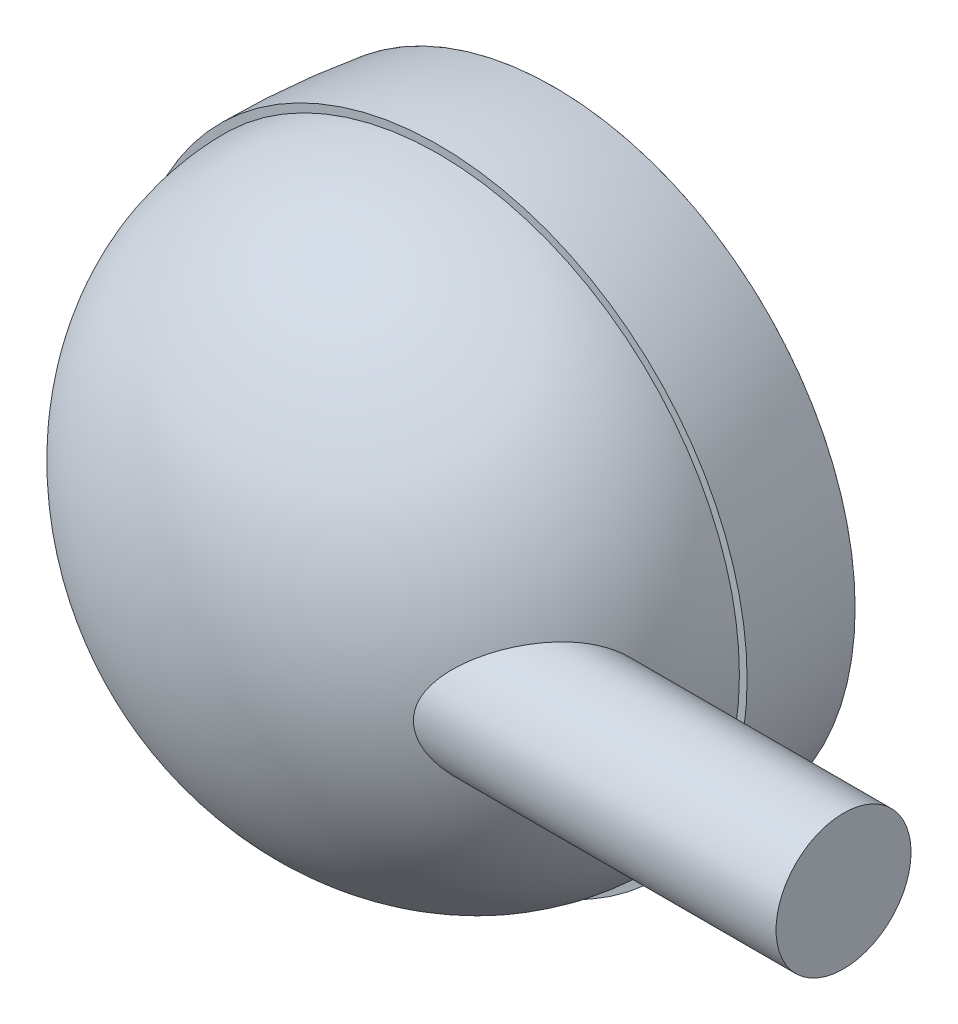
ISO-10303-21;
HEADER;
FILE_DESCRIPTION(('STEP AP214'),'2;1');
FILE_NAME('part.step','',(''),(''),'','','');
FILE_SCHEMA(('AUTOMOTIVE_DESIGN { 1 0 10303 214 1 1 1 1 }'));
ENDSEC;
DATA;
#1=APPLICATION_CONTEXT('core data for automotive mechanical design processes');
#2=APPLICATION_PROTOCOL_DEFINITION('international standard','automotive_design',2000,#1);
#3=PRODUCT_CONTEXT('',#1,'mechanical');
#4=PRODUCT('Part','Part','',(#3));
#5=PRODUCT_RELATED_PRODUCT_CATEGORY('part','',(#4));
#6=PRODUCT_DEFINITION_FORMATION('','',#4);
#7=PRODUCT_DEFINITION_CONTEXT('part definition',#1,'design');
#8=PRODUCT_DEFINITION('design','',#6,#7);
#9=PRODUCT_DEFINITION_SHAPE('','',#8);
#10=(LENGTH_UNIT() NAMED_UNIT(*) SI_UNIT(.MILLI.,.METRE.));
#11=(NAMED_UNIT(*) PLANE_ANGLE_UNIT() SI_UNIT($,.RADIAN.));
#12=(NAMED_UNIT(*) SI_UNIT($,.STERADIAN.) SOLID_ANGLE_UNIT());
#13=UNCERTAINTY_MEASURE_WITH_UNIT(LENGTH_MEASURE(1.E-05),#10,'distance_accuracy_value','');
#14=(GEOMETRIC_REPRESENTATION_CONTEXT(3) GLOBAL_UNCERTAINTY_ASSIGNED_CONTEXT((#13)) GLOBAL_UNIT_ASSIGNED_CONTEXT((#10,
#11,#12)) REPRESENTATION_CONTEXT('',''));
#15=CARTESIAN_POINT('',(0.,0.,0.));
#16=DIRECTION('',(0.,0.,1.));
#17=DIRECTION('',(1.,0.,0.));
#18=AXIS2_PLACEMENT_3D('',#15,#16,#17);
#19=CARTESIAN_POINT('',(0.,0.,195.299999999946));
#20=DIRECTION('',(0.,0.,1.));
#21=DIRECTION('',(0.,1.,0.));
#22=AXIS2_PLACEMENT_3D('',#19,#20,#21);
#23=SPHERICAL_SURFACE('',#22,210.299999999946);
#24=CARTESIAN_POINT('',(0.,0.,-2.22044604925031E-13));
#25=DIRECTION('',(0.,0.,1.));
#26=DIRECTION('',(1.,0.,0.));
#27=AXIS2_PLACEMENT_3D('',#24,#25,#26);
#28=CIRCLE('',#27,77.9999999999891);
#29=CARTESIAN_POINT('',(77.9999999999891,0.,-2.22044604925031E-13));
#30=VERTEX_POINT('',#29);
#31=EDGE_CURVE('E11',#30,#30,#28,.T.);
#32=ORIENTED_EDGE('',*,*,#31,.F.);
#33=EDGE_LOOP('',(#32));
#34=FACE_BOUND('',#33,.T.);
#35=ADVANCED_FACE('F44',(#34),#23,.T.);
#36=CARTESIAN_POINT('',(0.,0.,-1.94289029309402E-13));
#37=DIRECTION('',(0.,0.,-1.));
#38=DIRECTION('',(-1.,0.,0.));
#39=AXIS2_PLACEMENT_3D('',#36,#37,#38);
#40=PLANE('',#39);
#41=ORIENTED_EDGE('',*,*,#31,.T.);
#42=EDGE_LOOP('',(#41));
#43=FACE_BOUND('',#42,.T.);
#44=ADVANCED_FACE('F51',(#43),#40,.F.);
#45=CLOSED_SHELL('',(#35,#44));
#46=MANIFOLD_SOLID_BREP('B2',#45);
#47=CARTESIAN_POINT('',(0.,0.,30.0000000000043));
#48=DIRECTION('',(0.,0.,1.));
#49=DIRECTION('',(1.,0.,0.));
#50=AXIS2_PLACEMENT_3D('',#47,#48,#49);
#51=DEGENERATE_TOROIDAL_SURFACE('',#50,146.000000000078,226.000000000067,.F.);
#52=CARTESIAN_POINT('',(0.,0.,-1.66533453693773E-13));
#53=DIRECTION('',(0.,0.,1.));
#54=DIRECTION('',(1.,0.,0.));
#55=AXIS2_PLACEMENT_3D('',#52,#53,#54);
#56=CIRCLE('',#55,77.9999999999892);
#57=CARTESIAN_POINT('',(77.9999999999892,0.,-1.66533453693773E-13));
#58=VERTEX_POINT('',#57);
#59=EDGE_CURVE('E118',#58,#58,#56,.T.);
#60=ORIENTED_EDGE('',*,*,#59,.T.);
#61=EDGE_LOOP('',(#60));
#62=FACE_BOUND('',#61,.T.);
#63=CARTESIAN_POINT('',(0.,0.,30.0000000000043));
#64=DIRECTION('',(0.,0.,1.));
#65=DIRECTION('',(1.,0.,0.));
#66=AXIS2_PLACEMENT_3D('',#63,#64,#65);
#67=CIRCLE('',#66,79.9999999999892);
#68=CARTESIAN_POINT('',(79.9999999999892,0.,30.0000000000043));
#69=VERTEX_POINT('',#68);
#70=EDGE_CURVE('E80',#69,#69,#67,.T.);
#71=ORIENTED_EDGE('',*,*,#70,.F.);
#72=EDGE_LOOP('',(#71));
#73=FACE_BOUND('',#72,.T.);
#74=ADVANCED_FACE('F69',(#62,#73),#51,.F.);
#75=CARTESIAN_POINT('',(0.,77.9999999999892,30.0000000000043));
#76=DIRECTION('',(0.,0.,1.));
#77=DIRECTION('',(1.,0.,0.));
#78=AXIS2_PLACEMENT_3D('',#75,#76,#77);
#79=PLANE('',#78);
#80=ORIENTED_EDGE('',*,*,#70,.T.);
#81=EDGE_LOOP('',(#80));
#82=FACE_BOUND('',#81,.T.);
#83=CARTESIAN_POINT('',(0.,0.,30.0000000000043));
#84=DIRECTION('',(0.,0.,1.));
#85=DIRECTION('',(1.,0.,0.));
#86=AXIS2_PLACEMENT_3D('',#83,#84,#85);
#87=CIRCLE('',#86,77.9999999999892);
#88=CARTESIAN_POINT('',(77.9999999999892,0.,30.0000000000043));
#89=VERTEX_POINT('',#88);
#90=EDGE_CURVE('E96',#89,#89,#87,.T.);
#91=ORIENTED_EDGE('',*,*,#90,.F.);
#92=EDGE_LOOP('',(#91));
#93=FACE_BOUND('',#92,.T.);
#94=ADVANCED_FACE('F108',(#82,#93),#79,.T.);
#95=CARTESIAN_POINT('',(0.,0.,30.0000000000043));
#96=DIRECTION('',(-1.,0.,0.));
#97=DIRECTION('',(0.,-1.,0.));
#98=AXIS2_PLACEMENT_3D('',#95,#96,#97);
#99=ELLIPSE('',#98,77.9999999999892,64.9999999999957);
#100=TRIMMED_CURVE('',#99,(PARAMETER_VALUE(1.5707963267949)),
(PARAMETER_VALUE(4.71238898038469)),.T.,.PARAMETER.);
#101=CARTESIAN_POINT('',(0.,0.,0.));
#102=DIRECTION('',(0.,0.,1.));
#103=AXIS1_PLACEMENT('',#101,#102);
#104=SURFACE_OF_REVOLUTION('',#100,#103);
#105=CARTESIAN_POINT('',(75.1199041532764,0.,47.5));
#106=CARTESIAN_POINT('',(75.1199030988756,0.441337294526733,47.5000023716464));
#107=CARTESIAN_POINT('',(75.1104068143746,0.88270939619895,47.5167158029282));
#108=CARTESIAN_POINT('',(75.0724849158572,1.76228141678294,47.5833698180109));
#109=CARTESIAN_POINT('',(75.0440513927863,2.20047993293076,47.6333242847769));
#110=CARTESIAN_POINT('',(74.9684059953482,3.07098469469709,47.7659291748057));
#111=CARTESIAN_POINT('',(74.9211638678343,3.50328028127259,47.8486322722168));
#112=CARTESIAN_POINT('',(74.808265417896,4.35808694615993,48.0456657805257));
#113=CARTESIAN_POINT('',(74.7426109937457,4.78059902827444,48.159992931025));
#114=CARTESIAN_POINT('',(74.5935847398494,5.61180134300794,48.418486815739));
#115=CARTESIAN_POINT('',(74.5102642269917,6.0205277182503,48.5625670914354));
#116=CARTESIAN_POINT('',(74.326382989538,6.82284216515199,48.8790568735303));
#117=CARTESIAN_POINT('',(74.2258219157754,7.21642993001703,49.0514669536787));
#118=CARTESIAN_POINT('',(74.008177573557,7.98605894527983,49.4226019417578));
#119=CARTESIAN_POINT('',(73.8910995505319,8.36210571606618,49.6213184940845));
#120=CARTESIAN_POINT('',(73.6411519719796,9.09484823871754,50.0429804488868));
#121=CARTESIAN_POINT('',(73.5082820779889,9.45154357558887,50.2659263706562));
#122=CARTESIAN_POINT('',(73.2218083149783,10.1581635779326,50.7433910253821));
#123=CARTESIAN_POINT('',(73.0675781871766,10.5072127959567,50.9988288230882));
#124=CARTESIAN_POINT('',(72.7438389702357,11.1811750198276,51.5309357583114));
#125=CARTESIAN_POINT('',(72.5743295685133,11.5060875316377,51.8076053301705));
#126=CARTESIAN_POINT('',(72.2209726899244,12.1307872578784,52.3796429723754));
#127=CARTESIAN_POINT('',(72.0371221544148,12.4305690840553,52.6750150289999));
#128=CARTESIAN_POINT('',(71.6560832477778,13.0042397443878,53.2818882513566));
#129=CARTESIAN_POINT('',(71.4588932571939,13.2781254249483,53.5933913743762));
#130=CARTESIAN_POINT('',(71.0280736779412,13.8304328182797,54.2677640576636));
#131=CARTESIAN_POINT('',(70.7928938432229,14.1055528047932,54.6323488351976));
#132=CARTESIAN_POINT('',(70.3084190328221,14.6226306179156,55.3753657217193));
#133=CARTESIAN_POINT('',(70.0591231042211,14.8645862019538,55.7537987649344));
#134=CARTESIAN_POINT('',(69.5476221064933,15.3155316042682,56.521628201392));
#135=CARTESIAN_POINT('',(69.2854125271732,15.5245097962541,56.9110284043785));
#136=CARTESIAN_POINT('',(68.7493867827899,15.9097978449289,57.6979253956833));
#137=CARTESIAN_POINT('',(68.4755694285386,16.0861043444963,58.0954230113841));
#138=CARTESIAN_POINT('',(67.8728051710824,16.4322896443131,58.9601258184591));
#139=CARTESIAN_POINT('',(67.5420525318389,16.5966163871373,59.42829896485));
#140=CARTESIAN_POINT('',(66.8682573603626,16.8831926198345,60.3686432156477));
#141=CARTESIAN_POINT('',(66.5252137025955,17.0054382452538,60.8408146831567));
#142=CARTESIAN_POINT('',(65.8283740835944,17.2091683148731,61.7862145481392));
#143=CARTESIAN_POINT('',(65.4745747500889,17.2906398322257,62.2594432330866));
#144=CARTESIAN_POINT('',(64.7578748621341,17.4141254661165,63.2041192229866));
#145=CARTESIAN_POINT('',(64.3949739101234,17.4561378559755,63.6755664490859));
#146=CARTESIAN_POINT('',(63.5949865706987,17.5062261042092,64.6995120170836));
#147=CARTESIAN_POINT('',(63.1563830856608,17.5067646704752,65.2512018998732));
#148=CARTESIAN_POINT('',(62.2708235180635,17.4567957762665,66.3454949731854));
#149=CARTESIAN_POINT('',(61.8238665285998,17.4062827413687,66.888097164828));
#150=CARTESIAN_POINT('',(60.9234268063776,17.256058113021,67.9618643600195));
#151=CARTESIAN_POINT('',(60.4699378782694,17.1562963536894,68.4930171239388));
#152=CARTESIAN_POINT('',(59.5591773891282,16.909201413794,69.5407778607704));
#153=CARTESIAN_POINT('',(59.1019057344782,16.7618670524246,70.0573854723095));
#154=CARTESIAN_POINT('',(58.114213173434,16.3942163108973,71.1533764013935));
#155=CARTESIAN_POINT('',(57.5835431966084,16.1660871112997,71.7299323993245));
#156=CARTESIAN_POINT('',(56.5242128844872,15.649186395429,72.8573350545437));
#157=CARTESIAN_POINT('',(55.9955530412794,15.3604008952119,73.4081757474684));
#158=CARTESIAN_POINT('',(54.9450400328344,14.7226682513612,74.4806182522199));
#159=CARTESIAN_POINT('',(54.42318463635,14.3737413910094,75.0022298435175));
#160=CARTESIAN_POINT('',(53.6499518652642,13.8049432156936,75.7597939598167));
#161=CARTESIAN_POINT('',(53.3938148986426,13.6077894610905,76.0081585056034));
#162=CARTESIAN_POINT('',(52.8855342056962,13.1981222593125,76.4961321261375));
#163=CARTESIAN_POINT('',(52.6333901519067,12.9856100797408,76.7357419210037));
#164=CARTESIAN_POINT('',(52.0410929286211,12.462946879173,77.2931022406995));
#165=CARTESIAN_POINT('',(51.7031154428259,12.145896082252,77.6067404619576));
#166=CARTESIAN_POINT('',(51.0395329954141,11.4815976379977,78.2145983976275));
#167=CARTESIAN_POINT('',(50.7139278143619,11.1343505265867,78.5088184565087));
#168=CARTESIAN_POINT('',(50.0793191250373,10.4091562378704,79.0751862677124));
#169=CARTESIAN_POINT('',(49.7702933148353,10.0312521115493,79.3473639353509));
#170=CARTESIAN_POINT('',(49.1731941024798,9.24336135765733,79.8671748370825));
#171=CARTESIAN_POINT('',(48.8851137190129,8.83338551536034,80.1148162594187));
#172=CARTESIAN_POINT('',(48.41478590724,8.10306179811894,80.5148467414851));
#173=CARTESIAN_POINT('',(48.2258984964077,7.79077267952446,80.6741711700483));
#174=CARTESIAN_POINT('',(47.8644447890173,7.14941053631304,80.9769097827527));
#175=CARTESIAN_POINT('',(47.6918776297282,6.8203384003071,81.1203248079757));
#176=CARTESIAN_POINT('',(47.3662593126279,6.14610103002447,81.3892345353184));
#177=CARTESIAN_POINT('',(47.2131855209241,5.80095510725615,81.5147500413844));
#178=CARTESIAN_POINT('',(46.9296485158253,5.09506383342842,81.7459891459162));
#179=CARTESIAN_POINT('',(46.7991804919186,4.73432182168633,81.8517169555924));
#180=CARTESIAN_POINT('',(46.5864745402493,4.06827090654071,82.0233400197904));
#181=CARTESIAN_POINT('',(46.4997812786733,3.76534859209092,82.0929869529625));
#182=CARTESIAN_POINT('',(46.3453281982424,3.15158589146463,82.2167203812626));
#183=CARTESIAN_POINT('',(46.2775662601924,2.84074639580096,82.2708086180697));
#184=CARTESIAN_POINT('',(46.1626015904877,2.21309490038124,82.3623934895384));
#185=CARTESIAN_POINT('',(46.1153836985634,1.8962874853262,82.3999023591014));
#186=CARTESIAN_POINT('',(46.0426521845204,1.25860504551796,82.4576169605374));
#187=CARTESIAN_POINT('',(46.0171386698852,0.937730000629192,82.4778226067222));
#188=CARTESIAN_POINT('',(45.988475202733,0.293348031581408,82.5005199474279));
#189=CARTESIAN_POINT('',(45.9853949609074,-0.0301639717318232,82.5029564248469));
#190=CARTESIAN_POINT('',(46.0018697545674,-0.676244600377074,82.4899140908639));
#191=CARTESIAN_POINT('',(46.0214248824599,-0.998813221852431,82.4744352063242));
#192=CARTESIAN_POINT('',(46.0826357244434,-1.64063340040504,82.4258989118413));
#193=CARTESIAN_POINT('',(46.1243010059891,-1.9598834604601,82.3928338920522));
#194=CARTESIAN_POINT('',(46.228633162161,-2.5926814933893,82.309819498459));
#195=CARTESIAN_POINT('',(46.2913003832749,-2.90622937209947,82.259869846094));
#196=CARTESIAN_POINT('',(46.4335752587553,-3.51490016898477,82.1460775356199));
#197=CARTESIAN_POINT('',(46.5125128587528,-3.8102838031013,82.0827826242381));
#198=CARTESIAN_POINT('',(46.6869335915616,-4.39271053008627,81.9423681317625));
#199=CARTESIAN_POINT('',(46.7824158782915,-4.6797540485851,81.8652492576074));
#200=CARTESIAN_POINT('',(46.9882773221602,-5.24465353639595,81.6982150166927));
#201=CARTESIAN_POINT('',(47.0986589319346,-5.52250798366378,81.6082975429726));
#202=CARTESIAN_POINT('',(47.3326696006023,-6.06843553276385,81.4166934247225));
#203=CARTESIAN_POINT('',(47.4563018698402,-6.33650624302638,81.3150039276088));
#204=CARTESIAN_POINT('',(47.797491105193,-7.02958456239216,81.0327954565101));
#205=CARTESIAN_POINT('',(48.0248339401,-7.44614064251646,80.8432272542854));
#206=CARTESIAN_POINT('',(48.5046086265885,-8.25174099163238,80.4389803468052));
#207=CARTESIAN_POINT('',(48.7570533790293,-8.64077093624045,80.2242887195079));
#208=CARTESIAN_POINT('',(49.2825496734629,-9.39255882642237,79.7723614067851));
#209=CARTESIAN_POINT('',(49.5556526757508,-9.75524643710041,79.535069014356));
#210=CARTESIAN_POINT('',(50.1176678056936,-10.4539090354808,79.0409705133395));
#211=CARTESIAN_POINT('',(50.4065794520542,-10.7898848356615,78.7841649987371));
#212=CARTESIAN_POINT('',(51.1303635279474,-11.5821378920401,78.1329011885117));
#213=CARTESIAN_POINT('',(51.5721679627054,-12.0241239989936,77.7287037336805));
#214=CARTESIAN_POINT('',(52.4740576586644,-12.8558428670665,76.8881045253753));
#215=CARTESIAN_POINT('',(52.9341508303896,-13.2455526909063,76.4516887648226));
#216=CARTESIAN_POINT('',(53.8666072763511,-13.9741600827533,75.5502937936146));
#217=CARTESIAN_POINT('',(54.338973480732,-14.3130453833351,75.0853077250506));
#218=CARTESIAN_POINT('',(55.2910783122246,-14.940578719492,74.1299330194922));
#219=CARTESIAN_POINT('',(55.7708159974304,-15.2292331162765,73.6395476092756));
#220=CARTESIAN_POINT('',(56.7467580773456,-15.7634266797108,72.6225329989581));
#221=CARTESIAN_POINT('',(57.2430603345128,-16.0076101810582,72.095285902478));
#222=CARTESIAN_POINT('',(58.2359524687311,-16.4424302000857,71.0193959185986));
#223=CARTESIAN_POINT('',(58.7325423539341,-16.6330651173768,70.4707523922893));
#224=CARTESIAN_POINT('',(59.7230888058505,-16.9595357829801,69.3545804156573));
#225=CARTESIAN_POINT('',(60.2170440474677,-17.0953461287846,68.7870433426947));
#226=CARTESIAN_POINT('',(61.1991447481749,-17.3101781984059,67.6363432853383));
#227=CARTESIAN_POINT('',(61.6872899550949,-17.3891974661234,67.0531796262575));
#228=CARTESIAN_POINT('',(62.7060372490393,-17.493357157392,65.8123533906807));
#229=CARTESIAN_POINT('',(63.2356765516076,-17.5119236057086,65.1533290022151));
#230=CARTESIAN_POINT('',(64.2804422939632,-17.4731832985199,63.8257425496769));
#231=CARTESIAN_POINT('',(64.7955659951329,-17.4158623221418,63.1571787211943));
#232=CARTESIAN_POINT('',(65.8062221673587,-17.2216117198837,61.8183418982363));
#233=CARTESIAN_POINT('',(66.301784160597,-17.0848073703906,61.1480732422335));
#234=CARTESIAN_POINT('',(67.2695350885193,-16.7278815025432,59.8130069315591));
#235=CARTESIAN_POINT('',(67.7417356714358,-16.5078019892359,59.1482066910005));
#236=CARTESIAN_POINT('',(68.5138318700883,-16.0639663235245,58.0404960872319));
#237=CARTESIAN_POINT('',(68.821225802186,-15.8631187713824,57.5935350670616));
#238=CARTESIAN_POINT('',(69.4211086728775,-15.4199534095991,56.7103063276207));
#239=CARTESIAN_POINT('',(69.7136004418701,-15.1776435133793,56.2740365859646));
#240=CARTESIAN_POINT('',(70.2818242261626,-14.6511447918292,55.4163105427884));
#241=CARTESIAN_POINT('',(70.5575620354007,-14.3669705620047,54.9948491416844));
#242=CARTESIAN_POINT('',(71.0905478500991,-13.7566140885556,54.1709485361707));
#243=CARTESIAN_POINT('',(71.3477951304546,-13.4304301989235,53.7685100779563));
#244=CARTESIAN_POINT('',(71.8438182300699,-12.7338498823986,52.9843295404733));
#245=CARTESIAN_POINT('',(72.0824301589212,-12.3631212269276,52.6027783737262));
#246=CARTESIAN_POINT('',(72.5369219317727,-11.5807030068923,51.8689376838405));
#247=CARTESIAN_POINT('',(72.7528009401014,-11.169011937614,51.516649236512));
#248=CARTESIAN_POINT('',(73.0579489201473,-10.5226365754436,51.0143393470557));
#249=CARTESIAN_POINT('',(73.1565622425801,-10.3023477773238,50.8512412470596));
#250=CARTESIAN_POINT('',(73.3473504798168,-9.8524695069181,50.5343683130587));
#251=CARTESIAN_POINT('',(73.4395259539771,-9.62288084540207,50.3805926692203));
#252=CARTESIAN_POINT('',(73.6171690049325,-9.15489421457583,50.0830710006499));
#253=CARTESIAN_POINT('',(73.7026387550239,-8.91649913653732,49.9393217281048));
#254=CARTESIAN_POINT('',(73.8666985486347,-8.43125045436595,49.66239568624));
#255=CARTESIAN_POINT('',(73.94528627179,-8.18439403611862,49.5292224841775));
#256=CARTESIAN_POINT('',(74.1496196594847,-7.50134498209314,49.1818193918566));
#257=CARTESIAN_POINT('',(74.2683627758382,-7.05734579454579,48.9786286297455));
#258=CARTESIAN_POINT('',(74.4836098108007,-6.14927302664396,48.6086390056594));
#259=CARTESIAN_POINT('',(74.5801173465829,-5.68520272596705,48.44183422483));
#260=CARTESIAN_POINT('',(74.7074442168791,-4.9775555651298,48.2209974540097));
#261=CARTESIAN_POINT('',(74.7469499513438,-4.73999281945883,48.1523342888689));
#262=CARTESIAN_POINT('',(74.8201195319204,-4.26137280667777,48.024960070028));
#263=CARTESIAN_POINT('',(74.8537848976482,-4.02031646631294,47.9662464276365));
#264=CARTESIAN_POINT('',(74.9151870165111,-3.53531299305348,47.8590192869));
#265=CARTESIAN_POINT('',(74.9429263902417,-3.29136718852228,47.8105012799907));
#266=CARTESIAN_POINT('',(74.9924295861986,-2.80104836185896,47.7238277884595));
#267=CARTESIAN_POINT('',(75.0141933370468,-2.55467531077005,47.6856724276184));
#268=CARTESIAN_POINT('',(75.0618699637565,-1.92578002295206,47.6020271221792));
#269=CARTESIAN_POINT('',(75.0836231837845,-1.54194202954969,47.5637968867943));
#270=CARTESIAN_POINT('',(75.1126406434962,-0.772078215675352,47.5127824573894));
#271=CARTESIAN_POINT('',(75.1199050755959,-0.386052424326356,47.4999979254419));
#272=CARTESIAN_POINT('',(75.1199041532764,0.,47.5));
#273=B_SPLINE_CURVE_WITH_KNOTS('',3,(#105,#106,#107,#108,#109,#110,#111,#112,#113,#114,#115,
#116,#117,#118,#119,#120,#121,#122,#123,#124,#125,#126,#127,#128,#129,#130,#131,#132,#133,#134,
#135,#136,#137,#138,#139,#140,#141,#142,#143,#144,#145,#146,#147,#148,#149,#150,#151,#152,#153,
#154,#155,#156,#157,#158,#159,#160,#161,#162,#163,#164,#165,#166,#167,#168,#169,#170,#171,#172,
#173,#174,#175,#176,#177,#178,#179,#180,#181,#182,#183,#184,#185,#186,#187,#188,#189,#190,#191,
#192,#193,#194,#195,#196,#197,#198,#199,#200,#201,#202,#203,#204,#205,#206,#207,#208,#209,#210,
#211,#212,#213,#214,#215,#216,#217,#218,#219,#220,#221,#222,#223,#224,#225,#226,#227,#228,#229,
#230,#231,#232,#233,#234,#235,#236,#237,#238,#239,#240,#241,#242,#243,#244,#245,#246,#247,#248,
#249,#250,#251,#252,#253,#254,#255,#256,#257,#258,#259,#260,#261,#262,#263,#264,#265,#266,#267,
#268,#269,#270,#271,#272),.UNSPECIFIED.,.T.,.F.,(4,2,2,2,2,2,2,2,2,2,2,2,2,2,2,2,2,2,2,2,2,2,2,
2,2,2,2,2,2,2,2,2,2,2,2,2,2,2,2,2,2,2,2,2,2,2,2,2,2,2,2,2,2,2,2,2,2,2,2,2,2,2,2,2,2,2,2,2,2,2,2,
2,2,2,2,2,2,2,2,2,2,2,2,4),(0.,1.32365567004353,2.64786450601959,3.9742119584333,
5.30042271709535,6.62283259081284,7.94526924996443,9.26728687294213,10.5893328355386,
11.9655182391699,13.3417318031756,14.7182396895208,16.0949149896832,17.6345728882565,
19.1743348469124,20.7146384468398,22.2551002302713,24.0422852947318,25.8296344387832,
27.6175498779053,29.405543550191,31.517833728238,33.6303545762603,35.7450317405321,
37.859761397516,40.3054213356955,42.7516457261033,45.1970467111595,46.4195957600248,
47.6420440211314,49.3195175022938,50.9969612178307,52.672088810804,54.3466554833605,
55.540475787844,56.734232948572,57.9265911399443,59.1186952848003,60.0858253521713,
61.0528471144258,62.0191540574845,62.9854657858184,63.9547790213558,64.924096214043,
65.893833189865,66.8635861650927,67.7993808784685,68.7351277502074,69.6710288471708,
70.6071572072547,72.1377966869834,73.6692269286625,75.2046062891067,76.7399389308865,
78.9694612405342,81.1999586206678,83.4309935085579,85.6617456536848,87.9520097028039,
90.2423421930131,92.5337346749858,94.8252262490856,97.3588031415424,99.8928548791429,
102.422923406939,104.951717433718,106.685487348201,108.418926727101,110.15176318679,
111.884667562529,113.631408692159,115.378214010311,116.251794477488,117.125298948426,
117.998519140751,118.872032625996,120.377328304047,121.882378934944,122.633404009404,
123.384233379279,124.134730026471,124.885235637877,126.043096695901,127.200942377041),.UNSPECIFIED.);
#274=CARTESIAN_POINT('',(75.1199041532764,0.,47.5));
#275=VERTEX_POINT('',#274);
#276=EDGE_CURVE('E42',#275,#275,#273,.T.);
#277=ORIENTED_EDGE('',*,*,#276,.F.);
#278=EDGE_LOOP('',(#277));
#279=FACE_BOUND('',#278,.T.);
#280=ORIENTED_EDGE('',*,*,#90,.T.);
#281=EDGE_LOOP('',(#280));
#282=FACE_BOUND('',#281,.T.);
#283=CARTESIAN_POINT('',(0.,0.,95.));
#284=VERTEX_POINT('',#283);
#285=VERTEX_LOOP('',#284);
#286=FACE_BOUND('',#285,.T.);
#287=ADVANCED_FACE('F90',(#279,#282,#286),#104,.F.);
#288=CARTESIAN_POINT('',(0.,75.9616517186472,28.0000000000447));
#289=CARTESIAN_POINT('',(0.,76.2822661210761,36.3584952194145));
#290=CARTESIAN_POINT('',(0.,72.8605402602284,53.174403297463));
#291=CARTESIAN_POINT('',(0.,58.9945037109458,71.2567965119479));
#292=CARTESIAN_POINT('',(0.,43.4098754939791,82.2199787024936));
#293=CARTESIAN_POINT('',(0.,29.9598100748233,88.356938334153));
#294=CARTESIAN_POINT('',(0.,15.30055019059,92.1458804594032));
#295=CARTESIAN_POINT('',(0.,5.08065406977853,93.));
#296=CARTESIAN_POINT('',(0.,0.,93.));
#297=B_SPLINE_CURVE_WITH_KNOTS('',3,(#288,#289,#290,#291,#292,#293,#294,#295,#296),
.UNSPECIFIED.,.F.,.F.,(4,1,1,1,1,1,4),(1.5707963267949,1.97148391959087,2.37217151238683,
2.57251530878482,2.7728591051828,2.97320290158079,3.17354669797877),.UNSPECIFIED.);
#298=CARTESIAN_POINT('',(0.,0.,0.));
#299=DIRECTION('',(0.,0.,1.));
#300=AXIS1_PLACEMENT('',#298,#299);
#301=SURFACE_OF_REVOLUTION('',#297,#300);
#302=CARTESIAN_POINT('',(0.,0.,93.));
#303=VERTEX_POINT('',#302);
#304=VERTEX_LOOP('',#303);
#305=FACE_BOUND('',#304,.T.);
#306=CARTESIAN_POINT('',(0.,0.,28.0000000000447));
#307=DIRECTION('',(0.,0.,1.));
#308=DIRECTION('',(1.,0.,0.));
#309=AXIS2_PLACEMENT_3D('',#306,#307,#308);
#310=CIRCLE('',#309,75.9616517186472);
#311=CARTESIAN_POINT('',(75.9616517186472,0.,28.0000000000447));
#312=VERTEX_POINT('',#311);
#313=EDGE_CURVE('E94',#312,#312,#310,.T.);
#314=ORIENTED_EDGE('',*,*,#313,.F.);
#315=EDGE_LOOP('',(#314));
#316=FACE_BOUND('',#315,.T.);
#317=ADVANCED_FACE('F86',(#305,#316),#301,.F.);
#318=CARTESIAN_POINT('',(0.,75.9616517186472,28.0000000000245));
#319=DIRECTION('',(0.,0.,-1.));
#320=DIRECTION('',(-1.,0.,0.));
#321=AXIS2_PLACEMENT_3D('',#318,#319,#320);
#322=PLANE('',#321);
#323=ORIENTED_EDGE('',*,*,#313,.T.);
#324=EDGE_LOOP('',(#323));
#325=FACE_BOUND('',#324,.T.);
#326=CARTESIAN_POINT('',(0.,0.,28.0000000000043));
#327=DIRECTION('',(0.,0.,1.));
#328=DIRECTION('',(1.,0.,0.));
#329=AXIS2_PLACEMENT_3D('',#326,#327,#328);
#330=CIRCLE('',#329,77.9910712506085);
#331=CARTESIAN_POINT('',(77.9910712506085,0.,28.0000000000043));
#332=VERTEX_POINT('',#331);
#333=EDGE_CURVE('E97',#332,#332,#330,.T.);
#334=ORIENTED_EDGE('',*,*,#333,.F.);
#335=EDGE_LOOP('',(#334));
#336=FACE_BOUND('',#335,.T.);
#337=ADVANCED_FACE('F89',(#325,#336),#322,.T.);
#338=CARTESIAN_POINT('',(0.,0.,30.0000000000043));
#339=DIRECTION('',(0.,0.,1.));
#340=DIRECTION('',(1.,0.,0.));
#341=AXIS2_PLACEMENT_3D('',#338,#339,#340);
#342=DEGENERATE_TOROIDAL_SURFACE('',#341,146.000000000078,224.000000000067,.F.);
#343=ORIENTED_EDGE('',*,*,#333,.T.);
#344=EDGE_LOOP('',(#343));
#345=FACE_BOUND('',#344,.T.);
#346=CARTESIAN_POINT('',(0.,0.,-1.66533453693773E-13));
#347=DIRECTION('',(0.,0.,1.));
#348=DIRECTION('',(1.,0.,0.));
#349=AXIS2_PLACEMENT_3D('',#346,#347,#348);
#350=CIRCLE('',#349,75.9819812507205);
#351=CARTESIAN_POINT('',(75.9819812507205,0.,-1.66533453693773E-13));
#352=VERTEX_POINT('',#351);
#353=EDGE_CURVE('E102',#352,#352,#350,.T.);
#354=ORIENTED_EDGE('',*,*,#353,.F.);
#355=EDGE_LOOP('',(#354));
#356=FACE_BOUND('',#355,.T.);
#357=ADVANCED_FACE('F137',(#345,#356),#342,.T.);
#358=CARTESIAN_POINT('',(0.,77.9999999999892,-1.66533453693773E-13));
#359=DIRECTION('',(0.,0.,-1.));
#360=DIRECTION('',(-1.,0.,0.));
#361=AXIS2_PLACEMENT_3D('',#358,#359,#360);
#362=PLANE('',#361);
#363=ORIENTED_EDGE('',*,*,#353,.T.);
#364=EDGE_LOOP('',(#363));
#365=FACE_BOUND('',#364,.T.);
#366=ORIENTED_EDGE('',*,*,#59,.F.);
#367=EDGE_LOOP('',(#366));
#368=FACE_BOUND('',#367,.T.);
#369=ADVANCED_FACE('F140',(#365,#368),#362,.T.);
#370=CARTESIAN_POINT('',(140.,0.,65.));
#371=DIRECTION('',(1.,0.,0.));
#372=DIRECTION('',(0.,0.,-1.));
#373=AXIS2_PLACEMENT_3D('',#370,#371,#372);
#374=PLANE('',#373);
#375=CARTESIAN_POINT('',(140.,0.,65.));
#376=DIRECTION('',(1.,0.,0.));
#377=DIRECTION('',(0.,0.,-1.));
#378=AXIS2_PLACEMENT_3D('',#375,#376,#377);
#379=CIRCLE('',#378,17.5);
#380=CARTESIAN_POINT('',(140.,0.,47.5));
#381=VERTEX_POINT('',#380);
#382=EDGE_CURVE('E120',#381,#381,#379,.T.);
#383=ORIENTED_EDGE('',*,*,#382,.T.);
#384=EDGE_LOOP('',(#383));
#385=FACE_BOUND('',#384,.T.);
#386=ADVANCED_FACE('F143',(#385),#374,.T.);
#387=CARTESIAN_POINT('',(-500000.,0.,65.));
#388=DIRECTION('',(1.,0.,0.));
#389=DIRECTION('',(0.,0.,-1.));
#390=AXIS2_PLACEMENT_3D('',#387,#388,#389);
#391=CYLINDRICAL_SURFACE('',#390,17.5);
#392=ORIENTED_EDGE('',*,*,#276,.T.);
#393=EDGE_LOOP('',(#392));
#394=FACE_BOUND('',#393,.T.);
#395=ORIENTED_EDGE('',*,*,#382,.F.);
#396=EDGE_LOOP('',(#395));
#397=FACE_BOUND('',#396,.T.);
#398=ADVANCED_FACE('F145',(#394,#397),#391,.T.);
#399=CLOSED_SHELL('',(#74,#94,#287,#317,#337,#357,#369,#386,#398));
#400=MANIFOLD_SOLID_BREP('B6',#399);
#401=ADVANCED_BREP_SHAPE_REPRESENTATION('',(#18,#46,#400),#14);
#402=SHAPE_DEFINITION_REPRESENTATION(#9,#401);
ENDSEC;
END-ISO-10303-21;
